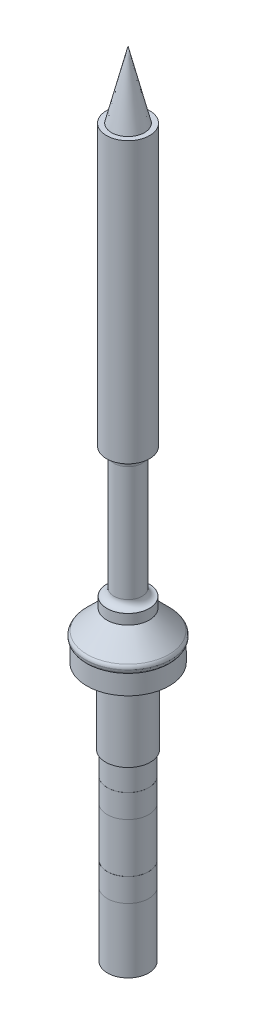
ISO-10303-21;
HEADER;
FILE_DESCRIPTION(('STEP AP214'),'2;1');
FILE_NAME('part.step','',(''),(''),'','','');
FILE_SCHEMA(('AUTOMOTIVE_DESIGN { 1 0 10303 214 1 1 1 1 }'));
ENDSEC;
DATA;
#1=APPLICATION_CONTEXT('core data for automotive mechanical design processes');
#2=APPLICATION_PROTOCOL_DEFINITION('international standard','automotive_design',2000,#1);
#3=PRODUCT_CONTEXT('',#1,'mechanical');
#4=PRODUCT('Part','Part','',(#3));
#5=PRODUCT_RELATED_PRODUCT_CATEGORY('part','',(#4));
#6=PRODUCT_DEFINITION_FORMATION('','',#4);
#7=PRODUCT_DEFINITION_CONTEXT('part definition',#1,'design');
#8=PRODUCT_DEFINITION('design','',#6,#7);
#9=PRODUCT_DEFINITION_SHAPE('','',#8);
#10=(LENGTH_UNIT() NAMED_UNIT(*) SI_UNIT(.MILLI.,.METRE.));
#11=(NAMED_UNIT(*) PLANE_ANGLE_UNIT() SI_UNIT($,.RADIAN.));
#12=(NAMED_UNIT(*) SI_UNIT($,.STERADIAN.) SOLID_ANGLE_UNIT());
#13=UNCERTAINTY_MEASURE_WITH_UNIT(LENGTH_MEASURE(1.E-05),#10,'distance_accuracy_value','');
#14=(GEOMETRIC_REPRESENTATION_CONTEXT(3) GLOBAL_UNCERTAINTY_ASSIGNED_CONTEXT((#13)) GLOBAL_UNIT_ASSIGNED_CONTEXT((#10,
#11,#12)) REPRESENTATION_CONTEXT('',''));
#15=CARTESIAN_POINT('',(0.,0.,0.));
#16=DIRECTION('',(0.,0.,1.));
#17=DIRECTION('',(1.,0.,0.));
#18=AXIS2_PLACEMENT_3D('',#15,#16,#17);
#19=CARTESIAN_POINT('',(0.,-15.3,0.));
#20=DIRECTION('',(0.,-1.,0.));
#21=DIRECTION('',(0.,0.,-1.));
#22=AXIS2_PLACEMENT_3D('',#19,#20,#21);
#23=PLANE('',#22);
#24=CARTESIAN_POINT('',(0.,-15.3,0.));
#25=DIRECTION('',(0.,-1.,0.));
#26=DIRECTION('',(0.,0.,-1.));
#27=AXIS2_PLACEMENT_3D('',#24,#25,#26);
#28=CIRCLE('',#27,2.66);
#29=CARTESIAN_POINT('',(0.,-15.3,-2.66));
#30=VERTEX_POINT('',#29);
#31=EDGE_CURVE('E11',#30,#30,#28,.T.);
#32=ORIENTED_EDGE('',*,*,#31,.T.);
#33=EDGE_LOOP('',(#32));
#34=FACE_BOUND('',#33,.T.);
#35=CARTESIAN_POINT('',(0.,-15.3,0.));
#36=DIRECTION('',(0.,-1.,0.));
#37=DIRECTION('',(0.,0.,-1.));
#38=AXIS2_PLACEMENT_3D('',#35,#36,#37);
#39=CIRCLE('',#38,2.65);
#40=CARTESIAN_POINT('',(0.,-15.3,-2.65));
#41=VERTEX_POINT('',#40);
#42=EDGE_CURVE('E56',#41,#41,#39,.T.);
#43=ORIENTED_EDGE('',*,*,#42,.F.);
#44=EDGE_LOOP('',(#43));
#45=FACE_BOUND('',#44,.T.);
#46=ADVANCED_FACE('F45',(#34,#45),#23,.T.);
#47=CARTESIAN_POINT('',(0.,-12.3,0.));
#48=DIRECTION('',(0.,-1.,0.));
#49=DIRECTION('',(0.,0.,-1.));
#50=AXIS2_PLACEMENT_3D('',#47,#48,#49);
#51=PLANE('',#50);
#52=CARTESIAN_POINT('',(0.,-12.3,0.));
#53=DIRECTION('',(0.,-1.,0.));
#54=DIRECTION('',(0.,0.,-1.));
#55=AXIS2_PLACEMENT_3D('',#52,#53,#54);
#56=CIRCLE('',#55,2.66);
#57=CARTESIAN_POINT('',(0.,-12.3,-2.66));
#58=VERTEX_POINT('',#57);
#59=EDGE_CURVE('E49',#58,#58,#56,.T.);
#60=ORIENTED_EDGE('',*,*,#59,.F.);
#61=EDGE_LOOP('',(#60));
#62=FACE_BOUND('',#61,.T.);
#63=CARTESIAN_POINT('',(0.,-12.3,0.));
#64=DIRECTION('',(0.,-1.,0.));
#65=DIRECTION('',(0.,0.,-1.));
#66=AXIS2_PLACEMENT_3D('',#63,#64,#65);
#67=CIRCLE('',#66,2.65);
#68=CARTESIAN_POINT('',(0.,-12.3,-2.65));
#69=VERTEX_POINT('',#68);
#70=EDGE_CURVE('E58',#69,#69,#67,.T.);
#71=ORIENTED_EDGE('',*,*,#70,.T.);
#72=EDGE_LOOP('',(#71));
#73=FACE_BOUND('',#72,.T.);
#74=ADVANCED_FACE('F68',(#62,#73),#51,.F.);
#75=CARTESIAN_POINT('',(0.,-15.3,0.));
#76=DIRECTION('',(0.,1.,0.));
#77=DIRECTION('',(0.,0.,1.));
#78=AXIS2_PLACEMENT_3D('',#75,#76,#77);
#79=CYLINDRICAL_SURFACE('',#78,2.66);
#80=ORIENTED_EDGE('',*,*,#31,.F.);
#81=EDGE_LOOP('',(#80));
#82=FACE_BOUND('',#81,.T.);
#83=ORIENTED_EDGE('',*,*,#59,.T.);
#84=EDGE_LOOP('',(#83));
#85=FACE_BOUND('',#84,.T.);
#86=ADVANCED_FACE('F47',(#82,#85),#79,.T.);
#87=CARTESIAN_POINT('',(0.,-15.3,0.));
#88=DIRECTION('',(0.,1.,0.));
#89=DIRECTION('',(0.,0.,1.));
#90=AXIS2_PLACEMENT_3D('',#87,#88,#89);
#91=CYLINDRICAL_SURFACE('',#90,2.65);
#92=ORIENTED_EDGE('',*,*,#42,.T.);
#93=EDGE_LOOP('',(#92));
#94=FACE_BOUND('',#93,.T.);
#95=ORIENTED_EDGE('',*,*,#70,.F.);
#96=EDGE_LOOP('',(#95));
#97=FACE_BOUND('',#96,.T.);
#98=ADVANCED_FACE('F64',(#94,#97),#91,.F.);
#99=CLOSED_SHELL('',(#46,#74,#86,#98));
#100=MANIFOLD_SOLID_BREP('B2',#99);
#101=CARTESIAN_POINT('',(0.,-5.95,0.));
#102=DIRECTION('',(0.,-1.,0.));
#103=DIRECTION('',(0.,0.,-1.));
#104=AXIS2_PLACEMENT_3D('',#101,#102,#103);
#105=PLANE('',#104);
#106=CARTESIAN_POINT('',(0.,-5.95,0.));
#107=DIRECTION('',(0.,-1.,0.));
#108=DIRECTION('',(0.,0.,-1.));
#109=AXIS2_PLACEMENT_3D('',#106,#107,#108);
#110=CIRCLE('',#109,2.66);
#111=CARTESIAN_POINT('',(0.,-5.95,-2.66));
#112=VERTEX_POINT('',#111);
#113=EDGE_CURVE('E44',#112,#112,#110,.T.);
#114=ORIENTED_EDGE('',*,*,#113,.T.);
#115=EDGE_LOOP('',(#114));
#116=FACE_BOUND('',#115,.T.);
#117=CARTESIAN_POINT('',(0.,-5.95,0.));
#118=DIRECTION('',(0.,-1.,0.));
#119=DIRECTION('',(0.,0.,-1.));
#120=AXIS2_PLACEMENT_3D('',#117,#118,#119);
#121=CIRCLE('',#120,2.65);
#122=CARTESIAN_POINT('',(0.,-5.95,-2.65));
#123=VERTEX_POINT('',#122);
#124=EDGE_CURVE('E125',#123,#123,#121,.T.);
#125=ORIENTED_EDGE('',*,*,#124,.F.);
#126=EDGE_LOOP('',(#125));
#127=FACE_BOUND('',#126,.T.);
#128=ADVANCED_FACE('F114',(#116,#127),#105,.T.);
#129=CARTESIAN_POINT('',(0.,-2.95,0.));
#130=DIRECTION('',(0.,-1.,0.));
#131=DIRECTION('',(0.,0.,-1.));
#132=AXIS2_PLACEMENT_3D('',#129,#130,#131);
#133=PLANE('',#132);
#134=CARTESIAN_POINT('',(0.,-2.95,0.));
#135=DIRECTION('',(0.,-1.,0.));
#136=DIRECTION('',(0.,0.,-1.));
#137=AXIS2_PLACEMENT_3D('',#134,#135,#136);
#138=CIRCLE('',#137,2.66);
#139=CARTESIAN_POINT('',(0.,-2.95,-2.66));
#140=VERTEX_POINT('',#139);
#141=EDGE_CURVE('E118',#140,#140,#138,.T.);
#142=ORIENTED_EDGE('',*,*,#141,.F.);
#143=EDGE_LOOP('',(#142));
#144=FACE_BOUND('',#143,.T.);
#145=CARTESIAN_POINT('',(0.,-2.95,0.));
#146=DIRECTION('',(0.,-1.,0.));
#147=DIRECTION('',(0.,0.,-1.));
#148=AXIS2_PLACEMENT_3D('',#145,#146,#147);
#149=CIRCLE('',#148,2.65);
#150=CARTESIAN_POINT('',(0.,-2.95,-2.65));
#151=VERTEX_POINT('',#150);
#152=EDGE_CURVE('E127',#151,#151,#149,.T.);
#153=ORIENTED_EDGE('',*,*,#152,.T.);
#154=EDGE_LOOP('',(#153));
#155=FACE_BOUND('',#154,.T.);
#156=ADVANCED_FACE('F137',(#144,#155),#133,.F.);
#157=CARTESIAN_POINT('',(0.,-5.95,0.));
#158=DIRECTION('',(0.,1.,0.));
#159=DIRECTION('',(0.,0.,1.));
#160=AXIS2_PLACEMENT_3D('',#157,#158,#159);
#161=CYLINDRICAL_SURFACE('',#160,2.66);
#162=ORIENTED_EDGE('',*,*,#113,.F.);
#163=EDGE_LOOP('',(#162));
#164=FACE_BOUND('',#163,.T.);
#165=ORIENTED_EDGE('',*,*,#141,.T.);
#166=EDGE_LOOP('',(#165));
#167=FACE_BOUND('',#166,.T.);
#168=ADVANCED_FACE('F116',(#164,#167),#161,.T.);
#169=CARTESIAN_POINT('',(0.,-5.95,0.));
#170=DIRECTION('',(0.,1.,0.));
#171=DIRECTION('',(0.,0.,1.));
#172=AXIS2_PLACEMENT_3D('',#169,#170,#171);
#173=CYLINDRICAL_SURFACE('',#172,2.65);
#174=ORIENTED_EDGE('',*,*,#124,.T.);
#175=EDGE_LOOP('',(#174));
#176=FACE_BOUND('',#175,.T.);
#177=ORIENTED_EDGE('',*,*,#152,.F.);
#178=EDGE_LOOP('',(#177));
#179=FACE_BOUND('',#178,.T.);
#180=ADVANCED_FACE('F133',(#176,#179),#173,.F.);
#181=CLOSED_SHELL('',(#128,#156,#168,#180));
#182=MANIFOLD_SOLID_BREP('B6',#181);
#183=CARTESIAN_POINT('',(0.,-23.6,0.));
#184=DIRECTION('',(0.,1.,0.));
#185=DIRECTION('',(0.,0.,1.));
#186=AXIS2_PLACEMENT_3D('',#183,#184,#185);
#187=CYLINDRICAL_SURFACE('',#186,2.65);
#188=CARTESIAN_POINT('',(0.,-23.6,0.));
#189=DIRECTION('',(0.,-1.,0.));
#190=DIRECTION('',(0.,0.,-1.));
#191=AXIS2_PLACEMENT_3D('',#188,#189,#190);
#192=CIRCLE('',#191,2.65);
#193=CARTESIAN_POINT('',(0.,-23.6,-2.65));
#194=VERTEX_POINT('',#193);
#195=EDGE_CURVE('E113',#194,#194,#192,.T.);
#196=ORIENTED_EDGE('',*,*,#195,.F.);
#197=EDGE_LOOP('',(#196));
#198=FACE_BOUND('',#197,.T.);
#199=CARTESIAN_POINT('',(0.,0.,0.));
#200=DIRECTION('',(0.,-1.,0.));
#201=DIRECTION('',(0.,0.,-1.));
#202=AXIS2_PLACEMENT_3D('',#199,#200,#201);
#203=CIRCLE('',#202,2.65);
#204=CARTESIAN_POINT('',(0.,0.,-2.65));
#205=VERTEX_POINT('',#204);
#206=EDGE_CURVE('E187',#205,#205,#203,.T.);
#207=ORIENTED_EDGE('',*,*,#206,.T.);
#208=EDGE_LOOP('',(#207));
#209=FACE_BOUND('',#208,.T.);
#210=ADVANCED_FACE('F184',(#198,#209),#187,.T.);
#211=CARTESIAN_POINT('',(0.,-23.6,0.));
#212=DIRECTION('',(0.,-1.,0.));
#213=DIRECTION('',(0.,0.,-1.));
#214=AXIS2_PLACEMENT_3D('',#211,#212,#213);
#215=PLANE('',#214);
#216=ORIENTED_EDGE('',*,*,#195,.T.);
#217=EDGE_LOOP('',(#216));
#218=FACE_BOUND('',#217,.T.);
#219=ADVANCED_FACE('F199',(#218),#215,.T.);
#220=CARTESIAN_POINT('',(0.,0.,0.));
#221=DIRECTION('',(0.,-1.,0.));
#222=DIRECTION('',(0.,0.,-1.));
#223=AXIS2_PLACEMENT_3D('',#220,#221,#222);
#224=PLANE('',#223);
#225=ORIENTED_EDGE('',*,*,#206,.F.);
#226=EDGE_LOOP('',(#225));
#227=FACE_BOUND('',#226,.T.);
#228=ADVANCED_FACE('F197',(#227),#224,.F.);
#229=CLOSED_SHELL('',(#210,#219,#228));
#230=MANIFOLD_SOLID_BREP('B39',#229);
#231=CARTESIAN_POINT('',(0.,9.7,0.));
#232=DIRECTION('',(0.,-1.,0.));
#233=DIRECTION('',(0.,0.,-1.));
#234=AXIS2_PLACEMENT_3D('',#231,#232,#233);
#235=CYLINDRICAL_SURFACE('',#234,2.875);
#236=CARTESIAN_POINT('',(0.,9.4,0.));
#237=DIRECTION('',(0.,1.,0.));
#238=DIRECTION('',(0.,0.,1.));
#239=AXIS2_PLACEMENT_3D('',#236,#237,#238);
#240=CIRCLE('',#239,2.875);
#241=CARTESIAN_POINT('',(0.,9.4,2.875));
#242=VERTEX_POINT('',#241);
#243=EDGE_CURVE('E182',#242,#242,#240,.F.);
#244=ORIENTED_EDGE('',*,*,#243,.T.);
#245=EDGE_LOOP('',(#244));
#246=FACE_BOUND('',#245,.T.);
#247=CARTESIAN_POINT('',(0.,0.,0.));
#248=DIRECTION('',(0.,1.,0.));
#249=DIRECTION('',(0.,0.,1.));
#250=AXIS2_PLACEMENT_3D('',#247,#248,#249);
#251=CIRCLE('',#250,2.875);
#252=CARTESIAN_POINT('',(0.,0.,2.875));
#253=VERTEX_POINT('',#252);
#254=EDGE_CURVE('E263',#253,#253,#251,.T.);
#255=ORIENTED_EDGE('',*,*,#254,.T.);
#256=EDGE_LOOP('',(#255));
#257=FACE_BOUND('',#256,.T.);
#258=ADVANCED_FACE('F225',(#246,#257),#235,.T.);
#259=CARTESIAN_POINT('',(0.,0.,0.));
#260=DIRECTION('',(0.,1.,0.));
#261=DIRECTION('',(0.,0.,1.));
#262=AXIS2_PLACEMENT_3D('',#259,#260,#261);
#263=PLANE('',#262);
#264=ORIENTED_EDGE('',*,*,#254,.F.);
#265=EDGE_LOOP('',(#264));
#266=FACE_BOUND('',#265,.T.);
#267=ADVANCED_FACE('F301',(#266),#263,.F.);
#268=CARTESIAN_POINT('',(0.,12.2,0.));
#269=DIRECTION('',(0.,-1.,0.));
#270=DIRECTION('',(0.,0.,-1.));
#271=AXIS2_PLACEMENT_3D('',#268,#269,#270);
#272=CYLINDRICAL_SURFACE('',#271,5.3);
#273=CARTESIAN_POINT('',(0.,12.2,0.));
#274=DIRECTION('',(0.,1.,0.));
#275=DIRECTION('',(0.,0.,1.));
#276=AXIS2_PLACEMENT_3D('',#273,#274,#275);
#277=CIRCLE('',#276,5.3);
#278=CARTESIAN_POINT('',(0.,12.2,5.3));
#279=VERTEX_POINT('',#278);
#280=EDGE_CURVE('E260',#279,#279,#277,.T.);
#281=ORIENTED_EDGE('',*,*,#280,.F.);
#282=EDGE_LOOP('',(#281));
#283=FACE_BOUND('',#282,.T.);
#284=CARTESIAN_POINT('',(0.,9.7,0.));
#285=DIRECTION('',(0.,1.,0.));
#286=DIRECTION('',(0.,0.,1.));
#287=AXIS2_PLACEMENT_3D('',#284,#285,#286);
#288=CIRCLE('',#287,5.3);
#289=CARTESIAN_POINT('',(0.,9.7,5.3));
#290=VERTEX_POINT('',#289);
#291=EDGE_CURVE('E259',#290,#290,#288,.T.);
#292=ORIENTED_EDGE('',*,*,#291,.T.);
#293=EDGE_LOOP('',(#292));
#294=FACE_BOUND('',#293,.T.);
#295=ADVANCED_FACE('F309',(#283,#294),#272,.T.);
#296=CARTESIAN_POINT('',(0.,9.7,0.));
#297=DIRECTION('',(0.,1.,0.));
#298=DIRECTION('',(0.,0.,1.));
#299=AXIS2_PLACEMENT_3D('',#296,#297,#298);
#300=PLANE('',#299);
#301=CARTESIAN_POINT('',(0.,9.7,0.));
#302=DIRECTION('',(0.,1.,0.));
#303=DIRECTION('',(0.,0.,1.));
#304=AXIS2_PLACEMENT_3D('',#301,#302,#303);
#305=CIRCLE('',#304,3.175);
#306=CARTESIAN_POINT('',(0.,9.7,3.175));
#307=VERTEX_POINT('',#306);
#308=EDGE_CURVE('E232',#307,#307,#305,.T.);
#309=ORIENTED_EDGE('',*,*,#308,.T.);
#310=EDGE_LOOP('',(#309));
#311=FACE_BOUND('',#310,.T.);
#312=ORIENTED_EDGE('',*,*,#291,.F.);
#313=EDGE_LOOP('',(#312));
#314=FACE_BOUND('',#313,.T.);
#315=ADVANCED_FACE('F288',(#311,#314),#300,.F.);
#316=CARTESIAN_POINT('',(0.,13.,0.));
#317=DIRECTION('',(0.,-1.,0.));
#318=DIRECTION('',(0.,0.,-1.));
#319=AXIS2_PLACEMENT_3D('',#316,#317,#318);
#320=CYLINDRICAL_SURFACE('',#319,5.475);
#321=CARTESIAN_POINT('',(0.,12.6630064794363,0.));
#322=DIRECTION('',(0.,-1.,0.));
#323=DIRECTION('',(0.,0.,-1.));
#324=AXIS2_PLACEMENT_3D('',#321,#322,#323);
#325=CIRCLE('',#324,5.475);
#326=CARTESIAN_POINT('',(0.,12.6630064794363,-5.475));
#327=VERTEX_POINT('',#326);
#328=EDGE_CURVE('E271',#327,#327,#325,.F.);
#329=ORIENTED_EDGE('',*,*,#328,.T.);
#330=EDGE_LOOP('',(#329));
#331=FACE_BOUND('',#330,.T.);
#332=CARTESIAN_POINT('',(0.,12.7100505063388,0.));
#333=DIRECTION('',(0.,-1.,0.));
#334=DIRECTION('',(0.,0.,-1.));
#335=AXIS2_PLACEMENT_3D('',#332,#333,#334);
#336=CIRCLE('',#335,5.475);
#337=CARTESIAN_POINT('',(0.,12.7100505063388,-5.475));
#338=VERTEX_POINT('',#337);
#339=EDGE_CURVE('E268',#338,#338,#336,.T.);
#340=ORIENTED_EDGE('',*,*,#339,.T.);
#341=EDGE_LOOP('',(#340));
#342=FACE_BOUND('',#341,.T.);
#343=ADVANCED_FACE('F353',(#331,#342),#320,.T.);
#344=CARTESIAN_POINT('',(0.,13.,0.));
#345=DIRECTION('',(0.,-1.,0.));
#346=DIRECTION('',(0.,0.,1.));
#347=AXIS2_PLACEMENT_3D('',#344,#345,#346);
#348=CONICAL_SURFACE('',#347,5.475,0.78539816339745);
#349=CARTESIAN_POINT('',(0.,13.2050252531694,0.));
#350=DIRECTION('',(0.,1.,0.));
#351=DIRECTION('',(0.,0.,1.));
#352=AXIS2_PLACEMENT_3D('',#349,#350,#351);
#353=CIRCLE('',#352,5.26997474683058);
#354=CARTESIAN_POINT('',(0.,13.2050252531694,5.26997474683058));
#355=VERTEX_POINT('',#354);
#356=EDGE_CURVE('E274',#355,#355,#353,.T.);
#357=ORIENTED_EDGE('',*,*,#356,.T.);
#358=EDGE_LOOP('',(#357));
#359=FACE_BOUND('',#358,.T.);
#360=CARTESIAN_POINT('',(0.,15.75,0.));
#361=DIRECTION('',(0.,1.,0.));
#362=DIRECTION('',(0.,0.,1.));
#363=AXIS2_PLACEMENT_3D('',#360,#361,#362);
#364=CIRCLE('',#363,2.72499999999999);
#365=CARTESIAN_POINT('',(0.,15.75,2.72499999999999));
#366=VERTEX_POINT('',#365);
#367=EDGE_CURVE('E256',#366,#366,#364,.T.);
#368=ORIENTED_EDGE('',*,*,#367,.F.);
#369=EDGE_LOOP('',(#368));
#370=FACE_BOUND('',#369,.T.);
#371=ADVANCED_FACE('F349',(#359,#370),#348,.T.);
#372=CARTESIAN_POINT('',(0.,17.05,0.));
#373=DIRECTION('',(0.,-1.,0.));
#374=DIRECTION('',(0.,0.,-1.));
#375=AXIS2_PLACEMENT_3D('',#372,#373,#374);
#376=CYLINDRICAL_SURFACE('',#375,2.72499999999999);
#377=CARTESIAN_POINT('',(0.,17.05,0.));
#378=DIRECTION('',(0.,1.,0.));
#379=DIRECTION('',(0.,0.,1.));
#380=AXIS2_PLACEMENT_3D('',#377,#378,#379);
#381=CIRCLE('',#380,2.72499999999999);
#382=CARTESIAN_POINT('',(0.,17.05,2.72499999999999));
#383=VERTEX_POINT('',#382);
#384=EDGE_CURVE('E252',#383,#383,#381,.T.);
#385=ORIENTED_EDGE('',*,*,#384,.F.);
#386=EDGE_LOOP('',(#385));
#387=FACE_BOUND('',#386,.T.);
#388=ORIENTED_EDGE('',*,*,#367,.T.);
#389=EDGE_LOOP('',(#388));
#390=FACE_BOUND('',#389,.T.);
#391=ADVANCED_FACE('F342',(#387,#390),#376,.T.);
#392=CARTESIAN_POINT('',(0.,17.05,0.));
#393=DIRECTION('',(0.,1.,0.));
#394=DIRECTION('',(0.,0.,1.));
#395=AXIS2_PLACEMENT_3D('',#392,#393,#394);
#396=PLANE('',#395);
#397=CARTESIAN_POINT('',(0.,17.05,0.));
#398=DIRECTION('',(0.,1.,0.));
#399=DIRECTION('',(0.,0.,1.));
#400=AXIS2_PLACEMENT_3D('',#397,#398,#399);
#401=CIRCLE('',#400,2.705);
#402=CARTESIAN_POINT('',(0.,17.05,2.705));
#403=VERTEX_POINT('',#402);
#404=EDGE_CURVE('E280',#403,#403,#401,.F.);
#405=ORIENTED_EDGE('',*,*,#404,.T.);
#406=EDGE_LOOP('',(#405));
#407=FACE_BOUND('',#406,.T.);
#408=ORIENTED_EDGE('',*,*,#384,.T.);
#409=EDGE_LOOP('',(#408));
#410=FACE_BOUND('',#409,.T.);
#411=ADVANCED_FACE('F333',(#407,#410),#396,.T.);
#412=CARTESIAN_POINT('',(0.,33.75,0.));
#413=DIRECTION('',(0.,-1.,0.));
#414=DIRECTION('',(0.,0.,-1.));
#415=AXIS2_PLACEMENT_3D('',#412,#413,#414);
#416=CYLINDRICAL_SURFACE('',#415,1.805);
#417=CARTESIAN_POINT('',(0.,32.7504501012956,0.));
#418=DIRECTION('',(0.,1.,0.));
#419=DIRECTION('',(0.,0.,1.));
#420=AXIS2_PLACEMENT_3D('',#417,#418,#419);
#421=CIRCLE('',#420,1.805);
#422=CARTESIAN_POINT('',(0.,32.7504501012956,1.805));
#423=VERTEX_POINT('',#422);
#424=EDGE_CURVE('E283',#423,#423,#421,.F.);
#425=ORIENTED_EDGE('',*,*,#424,.T.);
#426=EDGE_LOOP('',(#425));
#427=FACE_BOUND('',#426,.T.);
#428=CARTESIAN_POINT('',(0.,17.95,0.));
#429=DIRECTION('',(0.,1.,0.));
#430=DIRECTION('',(0.,0.,1.));
#431=AXIS2_PLACEMENT_3D('',#428,#429,#430);
#432=CIRCLE('',#431,1.805);
#433=CARTESIAN_POINT('',(0.,17.95,1.805));
#434=VERTEX_POINT('',#433);
#435=EDGE_CURVE('E277',#434,#434,#432,.T.);
#436=ORIENTED_EDGE('',*,*,#435,.T.);
#437=EDGE_LOOP('',(#436));
#438=FACE_BOUND('',#437,.T.);
#439=ADVANCED_FACE('F330',(#427,#438),#416,.T.);
#440=CARTESIAN_POINT('',(0.,69.75,0.));
#441=DIRECTION('',(0.,-1.,0.));
#442=DIRECTION('',(0.,0.,-1.));
#443=AXIS2_PLACEMENT_3D('',#440,#441,#442);
#444=CYLINDRICAL_SURFACE('',#443,2.775);
#445=CARTESIAN_POINT('',(0.,69.75,0.));
#446=DIRECTION('',(0.,1.,0.));
#447=DIRECTION('',(0.,0.,1.));
#448=AXIS2_PLACEMENT_3D('',#445,#446,#447);
#449=CIRCLE('',#448,2.775);
#450=CARTESIAN_POINT('',(0.,69.75,2.775));
#451=VERTEX_POINT('',#450);
#452=EDGE_CURVE('E248',#451,#451,#449,.T.);
#453=ORIENTED_EDGE('',*,*,#452,.F.);
#454=EDGE_LOOP('',(#453));
#455=FACE_BOUND('',#454,.T.);
#456=CARTESIAN_POINT('',(0.,33.75,0.));
#457=DIRECTION('',(0.,1.,0.));
#458=DIRECTION('',(0.,0.,1.));
#459=AXIS2_PLACEMENT_3D('',#456,#457,#458);
#460=CIRCLE('',#459,2.775);
#461=CARTESIAN_POINT('',(0.,33.75,2.775));
#462=VERTEX_POINT('',#461);
#463=EDGE_CURVE('E245',#462,#462,#460,.T.);
#464=ORIENTED_EDGE('',*,*,#463,.T.);
#465=EDGE_LOOP('',(#464));
#466=FACE_BOUND('',#465,.T.);
#467=ADVANCED_FACE('F332',(#455,#466),#444,.T.);
#468=CARTESIAN_POINT('',(0.,69.75,0.));
#469=DIRECTION('',(0.,1.,0.));
#470=DIRECTION('',(0.,0.,1.));
#471=AXIS2_PLACEMENT_3D('',#468,#469,#470);
#472=PLANE('',#471);
#473=CARTESIAN_POINT('',(0.,69.75,0.));
#474=DIRECTION('',(0.,1.,0.));
#475=DIRECTION('',(0.,0.,1.));
#476=AXIS2_PLACEMENT_3D('',#473,#474,#475);
#477=CIRCLE('',#476,2.125);
#478=CARTESIAN_POINT('',(0.,69.75,2.125));
#479=VERTEX_POINT('',#478);
#480=EDGE_CURVE('E243',#479,#479,#477,.T.);
#481=ORIENTED_EDGE('',*,*,#480,.F.);
#482=EDGE_LOOP('',(#481));
#483=FACE_BOUND('',#482,.T.);
#484=ORIENTED_EDGE('',*,*,#452,.T.);
#485=EDGE_LOOP('',(#484));
#486=FACE_BOUND('',#485,.T.);
#487=ADVANCED_FACE('F239',(#483,#486),#472,.T.);
#488=CARTESIAN_POINT('',(0.,69.75,0.));
#489=DIRECTION('',(0.,-1.,0.));
#490=DIRECTION('',(0.,0.,1.));
#491=AXIS2_PLACEMENT_3D('',#488,#489,#490);
#492=CONICAL_SURFACE('',#491,2.125,0.242600766027212);
#493=CARTESIAN_POINT('',(0.,78.3367266039471,0.));
#494=VERTEX_POINT('',#493);
#495=VERTEX_LOOP('',#494);
#496=FACE_BOUND('',#495,.T.);
#497=ORIENTED_EDGE('',*,*,#480,.T.);
#498=EDGE_LOOP('',(#497));
#499=FACE_BOUND('',#498,.T.);
#500=ADVANCED_FACE('F235',(#496,#499),#492,.T.);
#501=CARTESIAN_POINT('',(0.,12.6630064794363,0.));
#502=DIRECTION('',(0.,-1.,0.));
#503=DIRECTION('',(0.,0.,-1.));
#504=AXIS2_PLACEMENT_3D('',#501,#502,#503);
#505=TOROIDAL_SURFACE('',#504,4.775,0.7);
#506=ORIENTED_EDGE('',*,*,#280,.T.);
#507=EDGE_LOOP('',(#506));
#508=FACE_BOUND('',#507,.T.);
#509=ORIENTED_EDGE('',*,*,#328,.F.);
#510=EDGE_LOOP('',(#509));
#511=FACE_BOUND('',#510,.T.);
#512=ADVANCED_FACE('F238',(#508,#511),#505,.T.);
#513=CARTESIAN_POINT('',(0.,12.7100505063388,0.));
#514=DIRECTION('',(0.,-1.,0.));
#515=DIRECTION('',(0.,0.,-1.));
#516=AXIS2_PLACEMENT_3D('',#513,#514,#515);
#517=TOROIDAL_SURFACE('',#516,4.775,0.7);
#518=ORIENTED_EDGE('',*,*,#339,.F.);
#519=EDGE_LOOP('',(#518));
#520=FACE_BOUND('',#519,.T.);
#521=ORIENTED_EDGE('',*,*,#356,.F.);
#522=EDGE_LOOP('',(#521));
#523=FACE_BOUND('',#522,.T.);
#524=ADVANCED_FACE('F317',(#520,#523),#517,.T.);
#525=CARTESIAN_POINT('',(0.,17.95,0.));
#526=DIRECTION('',(0.,1.,0.));
#527=DIRECTION('',(0.,0.,1.));
#528=AXIS2_PLACEMENT_3D('',#525,#526,#527);
#529=TOROIDAL_SURFACE('',#528,2.705,0.9);
#530=ORIENTED_EDGE('',*,*,#404,.F.);
#531=EDGE_LOOP('',(#530));
#532=FACE_BOUND('',#531,.T.);
#533=ORIENTED_EDGE('',*,*,#435,.F.);
#534=EDGE_LOOP('',(#533));
#535=FACE_BOUND('',#534,.T.);
#536=ADVANCED_FACE('F297',(#532,#535),#529,.F.);
#537=CARTESIAN_POINT('',(0.,32.7504501012956,0.));
#538=DIRECTION('',(0.,1.,0.));
#539=DIRECTION('',(0.,0.,1.));
#540=AXIS2_PLACEMENT_3D('',#537,#538,#539);
#541=TOROIDAL_SURFACE('',#540,2.805,1.);
#542=ORIENTED_EDGE('',*,*,#424,.F.);
#543=EDGE_LOOP('',(#542));
#544=FACE_BOUND('',#543,.T.);
#545=ORIENTED_EDGE('',*,*,#463,.F.);
#546=EDGE_LOOP('',(#545));
#547=FACE_BOUND('',#546,.T.);
#548=ADVANCED_FACE('F292',(#544,#547),#541,.F.);
#549=CARTESIAN_POINT('',(0.,9.4,0.));
#550=DIRECTION('',(0.,1.,0.));
#551=DIRECTION('',(0.,0.,1.));
#552=AXIS2_PLACEMENT_3D('',#549,#550,#551);
#553=TOROIDAL_SURFACE('',#552,3.175,0.3);
#554=ORIENTED_EDGE('',*,*,#243,.F.);
#555=EDGE_LOOP('',(#554));
#556=FACE_BOUND('',#555,.T.);
#557=ORIENTED_EDGE('',*,*,#308,.F.);
#558=EDGE_LOOP('',(#557));
#559=FACE_BOUND('',#558,.T.);
#560=ADVANCED_FACE('F227',(#556,#559),#553,.F.);
#561=CLOSED_SHELL('',(#258,#267,#295,#315,#343,#371,#391,#411,#439,#467,#487,#500,#512,#524,
#536,#548,#560));
#562=MANIFOLD_SOLID_BREP('B108',#561);
#563=ADVANCED_BREP_SHAPE_REPRESENTATION('',(#18,#100,#182,#230,#562),#14);
#564=SHAPE_DEFINITION_REPRESENTATION(#9,#563);
ENDSEC;
END-ISO-10303-21;
